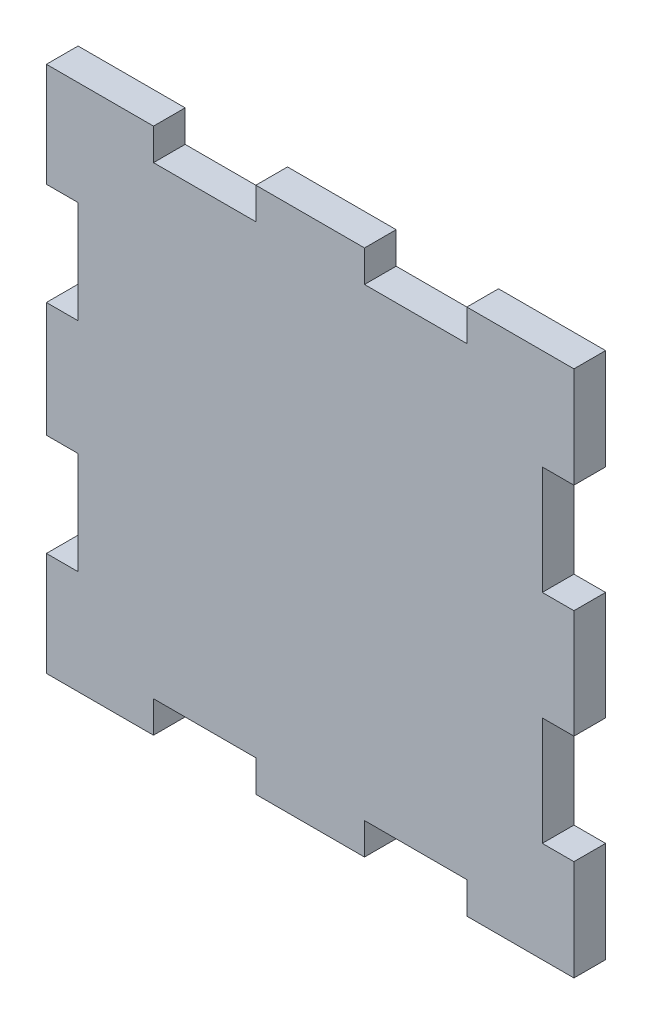
ISO-10303-21;
HEADER;
FILE_DESCRIPTION(('STEP AP214'),'2;1');
FILE_NAME('part.step','',(''),(''),'','','');
FILE_SCHEMA(('AUTOMOTIVE_DESIGN { 1 0 10303 214 1 1 1 1 }'));
ENDSEC;
DATA;
#1=APPLICATION_CONTEXT('core data for automotive mechanical design processes');
#2=APPLICATION_PROTOCOL_DEFINITION('international standard','automotive_design',2000,#1);
#3=PRODUCT_CONTEXT('',#1,'mechanical');
#4=PRODUCT('Part','Part','',(#3));
#5=PRODUCT_RELATED_PRODUCT_CATEGORY('part','',(#4));
#6=PRODUCT_DEFINITION_FORMATION('','',#4);
#7=PRODUCT_DEFINITION_CONTEXT('part definition',#1,'design');
#8=PRODUCT_DEFINITION('design','',#6,#7);
#9=PRODUCT_DEFINITION_SHAPE('','',#8);
#10=(LENGTH_UNIT() NAMED_UNIT(*) SI_UNIT(.MILLI.,.METRE.));
#11=(NAMED_UNIT(*) PLANE_ANGLE_UNIT() SI_UNIT($,.RADIAN.));
#12=(NAMED_UNIT(*) SI_UNIT($,.STERADIAN.) SOLID_ANGLE_UNIT());
#13=UNCERTAINTY_MEASURE_WITH_UNIT(LENGTH_MEASURE(1.E-05),#10,'distance_accuracy_value','');
#14=(GEOMETRIC_REPRESENTATION_CONTEXT(3) GLOBAL_UNCERTAINTY_ASSIGNED_CONTEXT((#13)) GLOBAL_UNIT_ASSIGNED_CONTEXT((#10,
#11,#12)) REPRESENTATION_CONTEXT('',''));
#15=CARTESIAN_POINT('',(0.,0.,0.));
#16=DIRECTION('',(0.,0.,1.));
#17=DIRECTION('',(1.,0.,0.));
#18=AXIS2_PLACEMENT_3D('',#15,#16,#17);
#19=CARTESIAN_POINT('',(14.85,25.,3.));
#20=DIRECTION('',(0.,-1.,0.));
#21=DIRECTION('',(1.,0.,0.));
#22=AXIS2_PLACEMENT_3D('',#19,#20,#21);
#23=PLANE('',#22);
#24=DIRECTION('',(-1.,0.,0.));
#25=VECTOR('',#24,1.);
#26=CARTESIAN_POINT('',(14.85,25.,0.));
#27=LINE('',#26,#25);
#28=CARTESIAN_POINT('',(25.,25.,0.));
#29=VERTEX_POINT('',#28);
#30=CARTESIAN_POINT('',(14.85,25.,0.));
#31=VERTEX_POINT('',#30);
#32=EDGE_CURVE('E301',#29,#31,#27,.T.);
#33=ORIENTED_EDGE('',*,*,#32,.T.);
#34=DIRECTION('',(0.,0.,-1.));
#35=VECTOR('',#34,1.);
#36=CARTESIAN_POINT('',(14.85,25.,3.));
#37=LINE('',#36,#35);
#38=CARTESIAN_POINT('',(14.85,25.,3.));
#39=VERTEX_POINT('',#38);
#40=EDGE_CURVE('E11',#39,#31,#37,.T.);
#41=ORIENTED_EDGE('',*,*,#40,.F.);
#42=DIRECTION('',(-1.,0.,0.));
#43=VECTOR('',#42,1.);
#44=CARTESIAN_POINT('',(14.85,25.,3.));
#45=LINE('',#44,#43);
#46=CARTESIAN_POINT('',(25.,25.,3.));
#47=VERTEX_POINT('',#46);
#48=EDGE_CURVE('E371',#47,#39,#45,.T.);
#49=ORIENTED_EDGE('',*,*,#48,.F.);
#50=DIRECTION('',(0.,0.,-1.));
#51=VECTOR('',#50,1.);
#52=CARTESIAN_POINT('',(25.,25.,3.));
#53=LINE('',#52,#51);
#54=EDGE_CURVE('E297',#47,#29,#53,.T.);
#55=ORIENTED_EDGE('',*,*,#54,.T.);
#56=EDGE_LOOP('',(#33,#41,#49,#55));
#57=FACE_BOUND('',#56,.T.);
#58=ADVANCED_FACE('F37',(#57),#23,.F.);
#59=CARTESIAN_POINT('',(14.85,25.,3.));
#60=DIRECTION('',(1.,0.,0.));
#61=DIRECTION('',(0.,1.,0.));
#62=AXIS2_PLACEMENT_3D('',#59,#60,#61);
#63=PLANE('',#62);
#64=DIRECTION('',(0.,-1.,0.));
#65=VECTOR('',#64,1.);
#66=CARTESIAN_POINT('',(14.85,25.,0.));
#67=LINE('',#66,#65);
#68=CARTESIAN_POINT('',(14.85,22.,0.));
#69=VERTEX_POINT('',#68);
#70=EDGE_CURVE('E304',#31,#69,#67,.T.);
#71=ORIENTED_EDGE('',*,*,#70,.T.);
#72=DIRECTION('',(0.,0.,-1.));
#73=VECTOR('',#72,1.);
#74=CARTESIAN_POINT('',(14.85,22.,3.));
#75=LINE('',#74,#73);
#76=CARTESIAN_POINT('',(14.85,22.,3.));
#77=VERTEX_POINT('',#76);
#78=EDGE_CURVE('E45',#77,#69,#75,.T.);
#79=ORIENTED_EDGE('',*,*,#78,.F.);
#80=DIRECTION('',(0.,-1.,0.));
#81=VECTOR('',#80,1.);
#82=CARTESIAN_POINT('',(14.85,25.,3.));
#83=LINE('',#82,#81);
#84=EDGE_CURVE('E180',#39,#77,#83,.T.);
#85=ORIENTED_EDGE('',*,*,#84,.F.);
#86=ORIENTED_EDGE('',*,*,#40,.T.);
#87=EDGE_LOOP('',(#71,#79,#85,#86));
#88=FACE_BOUND('',#87,.T.);
#89=ADVANCED_FACE('F569',(#88),#63,.F.);
#90=CARTESIAN_POINT('',(14.85,22.,3.));
#91=DIRECTION('',(0.,-1.,0.));
#92=DIRECTION('',(1.,0.,0.));
#93=AXIS2_PLACEMENT_3D('',#90,#91,#92);
#94=PLANE('',#93);
#95=DIRECTION('',(-1.,0.,0.));
#96=VECTOR('',#95,1.);
#97=CARTESIAN_POINT('',(14.85,22.,0.));
#98=LINE('',#97,#96);
#99=CARTESIAN_POINT('',(5.15,22.,0.));
#100=VERTEX_POINT('',#99);
#101=EDGE_CURVE('E306',#69,#100,#98,.T.);
#102=ORIENTED_EDGE('',*,*,#101,.T.);
#103=DIRECTION('',(0.,0.,-1.));
#104=VECTOR('',#103,1.);
#105=CARTESIAN_POINT('',(5.15,22.,3.));
#106=LINE('',#105,#104);
#107=CARTESIAN_POINT('',(5.15,22.,3.));
#108=VERTEX_POINT('',#107);
#109=EDGE_CURVE('E462',#108,#100,#106,.T.);
#110=ORIENTED_EDGE('',*,*,#109,.F.);
#111=DIRECTION('',(-1.,0.,0.));
#112=VECTOR('',#111,1.);
#113=CARTESIAN_POINT('',(14.85,22.,3.));
#114=LINE('',#113,#112);
#115=EDGE_CURVE('E470',#77,#108,#114,.T.);
#116=ORIENTED_EDGE('',*,*,#115,.F.);
#117=ORIENTED_EDGE('',*,*,#78,.T.);
#118=EDGE_LOOP('',(#102,#110,#116,#117));
#119=FACE_BOUND('',#118,.T.);
#120=ADVANCED_FACE('F468',(#119),#94,.F.);
#121=CARTESIAN_POINT('',(5.15,25.,3.));
#122=DIRECTION('',(-1.,0.,0.));
#123=DIRECTION('',(0.,-1.,0.));
#124=AXIS2_PLACEMENT_3D('',#121,#122,#123);
#125=PLANE('',#124);
#126=DIRECTION('',(0.,1.,0.));
#127=VECTOR('',#126,1.);
#128=CARTESIAN_POINT('',(5.15,25.,0.));
#129=LINE('',#128,#127);
#130=CARTESIAN_POINT('',(5.15,25.,0.));
#131=VERTEX_POINT('',#130);
#132=EDGE_CURVE('E308',#100,#131,#129,.T.);
#133=ORIENTED_EDGE('',*,*,#132,.T.);
#134=DIRECTION('',(0.,0.,-1.));
#135=VECTOR('',#134,1.);
#136=CARTESIAN_POINT('',(5.15,25.,3.));
#137=LINE('',#136,#135);
#138=CARTESIAN_POINT('',(5.15,25.,3.));
#139=VERTEX_POINT('',#138);
#140=EDGE_CURVE('E459',#139,#131,#137,.T.);
#141=ORIENTED_EDGE('',*,*,#140,.F.);
#142=DIRECTION('',(0.,1.,0.));
#143=VECTOR('',#142,1.);
#144=CARTESIAN_POINT('',(5.15,25.,3.));
#145=LINE('',#144,#143);
#146=EDGE_CURVE('E488',#108,#139,#145,.T.);
#147=ORIENTED_EDGE('',*,*,#146,.F.);
#148=ORIENTED_EDGE('',*,*,#109,.T.);
#149=EDGE_LOOP('',(#133,#141,#147,#148));
#150=FACE_BOUND('',#149,.T.);
#151=ADVANCED_FACE('F479',(#150),#125,.F.);
#152=CARTESIAN_POINT('',(-5.15,25.,3.));
#153=DIRECTION('',(0.,-1.,0.));
#154=DIRECTION('',(0.,0.,-1.));
#155=AXIS2_PLACEMENT_3D('',#152,#153,#154);
#156=PLANE('',#155);
#157=DIRECTION('',(-1.,0.,0.));
#158=VECTOR('',#157,1.);
#159=CARTESIAN_POINT('',(-5.15,25.,0.));
#160=LINE('',#159,#158);
#161=CARTESIAN_POINT('',(-5.15,25.,0.));
#162=VERTEX_POINT('',#161);
#163=EDGE_CURVE('E310',#131,#162,#160,.T.);
#164=ORIENTED_EDGE('',*,*,#163,.T.);
#165=DIRECTION('',(0.,0.,-1.));
#166=VECTOR('',#165,1.);
#167=CARTESIAN_POINT('',(-5.15,25.,3.));
#168=LINE('',#167,#166);
#169=CARTESIAN_POINT('',(-5.15,25.,3.));
#170=VERTEX_POINT('',#169);
#171=EDGE_CURVE('E456',#170,#162,#168,.T.);
#172=ORIENTED_EDGE('',*,*,#171,.F.);
#173=DIRECTION('',(-1.,0.,0.));
#174=VECTOR('',#173,1.);
#175=CARTESIAN_POINT('',(-5.15,25.,3.));
#176=LINE('',#175,#174);
#177=EDGE_CURVE('E485',#139,#170,#176,.T.);
#178=ORIENTED_EDGE('',*,*,#177,.F.);
#179=ORIENTED_EDGE('',*,*,#140,.T.);
#180=EDGE_LOOP('',(#164,#172,#178,#179));
#181=FACE_BOUND('',#180,.T.);
#182=ADVANCED_FACE('F483',(#181),#156,.F.);
#183=CARTESIAN_POINT('',(-5.15,25.,3.));
#184=DIRECTION('',(1.,0.,0.));
#185=DIRECTION('',(0.,1.,0.));
#186=AXIS2_PLACEMENT_3D('',#183,#184,#185);
#187=PLANE('',#186);
#188=DIRECTION('',(0.,-1.,0.));
#189=VECTOR('',#188,1.);
#190=CARTESIAN_POINT('',(-5.15,25.,0.));
#191=LINE('',#190,#189);
#192=CARTESIAN_POINT('',(-5.15,22.,0.));
#193=VERTEX_POINT('',#192);
#194=EDGE_CURVE('E312',#162,#193,#191,.T.);
#195=ORIENTED_EDGE('',*,*,#194,.T.);
#196=DIRECTION('',(0.,0.,-1.));
#197=VECTOR('',#196,1.);
#198=CARTESIAN_POINT('',(-5.15,22.,3.));
#199=LINE('',#198,#197);
#200=CARTESIAN_POINT('',(-5.15,22.,3.));
#201=VERTEX_POINT('',#200);
#202=EDGE_CURVE('E453',#201,#193,#199,.T.);
#203=ORIENTED_EDGE('',*,*,#202,.F.);
#204=DIRECTION('',(0.,-1.,0.));
#205=VECTOR('',#204,1.);
#206=CARTESIAN_POINT('',(-5.15,25.,3.));
#207=LINE('',#206,#205);
#208=EDGE_CURVE('E487',#170,#201,#207,.T.);
#209=ORIENTED_EDGE('',*,*,#208,.F.);
#210=ORIENTED_EDGE('',*,*,#171,.T.);
#211=EDGE_LOOP('',(#195,#203,#209,#210));
#212=FACE_BOUND('',#211,.T.);
#213=ADVANCED_FACE('F582',(#212),#187,.F.);
#214=CARTESIAN_POINT('',(-14.85,22.,3.));
#215=DIRECTION('',(0.,-1.,0.));
#216=DIRECTION('',(1.,0.,0.));
#217=AXIS2_PLACEMENT_3D('',#214,#215,#216);
#218=PLANE('',#217);
#219=DIRECTION('',(-1.,0.,0.));
#220=VECTOR('',#219,1.);
#221=CARTESIAN_POINT('',(-14.85,22.,0.));
#222=LINE('',#221,#220);
#223=CARTESIAN_POINT('',(-14.85,22.,0.));
#224=VERTEX_POINT('',#223);
#225=EDGE_CURVE('E314',#193,#224,#222,.T.);
#226=ORIENTED_EDGE('',*,*,#225,.T.);
#227=DIRECTION('',(0.,0.,-1.));
#228=VECTOR('',#227,1.);
#229=CARTESIAN_POINT('',(-14.85,22.,3.));
#230=LINE('',#229,#228);
#231=CARTESIAN_POINT('',(-14.85,22.,3.));
#232=VERTEX_POINT('',#231);
#233=EDGE_CURVE('E450',#232,#224,#230,.T.);
#234=ORIENTED_EDGE('',*,*,#233,.F.);
#235=DIRECTION('',(-1.,0.,0.));
#236=VECTOR('',#235,1.);
#237=CARTESIAN_POINT('',(-14.85,22.,3.));
#238=LINE('',#237,#236);
#239=EDGE_CURVE('E490',#201,#232,#238,.T.);
#240=ORIENTED_EDGE('',*,*,#239,.F.);
#241=ORIENTED_EDGE('',*,*,#202,.T.);
#242=EDGE_LOOP('',(#226,#234,#240,#241));
#243=FACE_BOUND('',#242,.T.);
#244=ADVANCED_FACE('F585',(#243),#218,.F.);
#245=CARTESIAN_POINT('',(-14.85,25.,3.));
#246=DIRECTION('',(-1.,0.,0.));
#247=DIRECTION('',(0.,-1.,0.));
#248=AXIS2_PLACEMENT_3D('',#245,#246,#247);
#249=PLANE('',#248);
#250=DIRECTION('',(0.,1.,0.));
#251=VECTOR('',#250,1.);
#252=CARTESIAN_POINT('',(-14.85,25.,0.));
#253=LINE('',#252,#251);
#254=CARTESIAN_POINT('',(-14.85,25.,0.));
#255=VERTEX_POINT('',#254);
#256=EDGE_CURVE('E316',#224,#255,#253,.T.);
#257=ORIENTED_EDGE('',*,*,#256,.T.);
#258=DIRECTION('',(0.,0.,-1.));
#259=VECTOR('',#258,1.);
#260=CARTESIAN_POINT('',(-14.85,25.,3.));
#261=LINE('',#260,#259);
#262=CARTESIAN_POINT('',(-14.85,25.,3.));
#263=VERTEX_POINT('',#262);
#264=EDGE_CURVE('E447',#263,#255,#261,.T.);
#265=ORIENTED_EDGE('',*,*,#264,.F.);
#266=DIRECTION('',(0.,1.,0.));
#267=VECTOR('',#266,1.);
#268=CARTESIAN_POINT('',(-14.85,25.,3.));
#269=LINE('',#268,#267);
#270=EDGE_CURVE('E496',#232,#263,#269,.T.);
#271=ORIENTED_EDGE('',*,*,#270,.F.);
#272=ORIENTED_EDGE('',*,*,#233,.T.);
#273=EDGE_LOOP('',(#257,#265,#271,#272));
#274=FACE_BOUND('',#273,.T.);
#275=ADVANCED_FACE('F589',(#274),#249,.F.);
#276=CARTESIAN_POINT('',(-25.,25.,3.));
#277=DIRECTION('',(0.,-1.,0.));
#278=DIRECTION('',(0.,0.,-1.));
#279=AXIS2_PLACEMENT_3D('',#276,#277,#278);
#280=PLANE('',#279);
#281=DIRECTION('',(-1.,0.,0.));
#282=VECTOR('',#281,1.);
#283=CARTESIAN_POINT('',(-25.,25.,0.));
#284=LINE('',#283,#282);
#285=CARTESIAN_POINT('',(-25.,25.,0.));
#286=VERTEX_POINT('',#285);
#287=EDGE_CURVE('E318',#255,#286,#284,.T.);
#288=ORIENTED_EDGE('',*,*,#287,.T.);
#289=DIRECTION('',(0.,0.,-1.));
#290=VECTOR('',#289,1.);
#291=CARTESIAN_POINT('',(-25.,25.,3.));
#292=LINE('',#291,#290);
#293=CARTESIAN_POINT('',(-25.,25.,3.));
#294=VERTEX_POINT('',#293);
#295=EDGE_CURVE('E444',#294,#286,#292,.T.);
#296=ORIENTED_EDGE('',*,*,#295,.F.);
#297=DIRECTION('',(-1.,0.,0.));
#298=VECTOR('',#297,1.);
#299=CARTESIAN_POINT('',(-25.,25.,3.));
#300=LINE('',#299,#298);
#301=EDGE_CURVE('E498',#263,#294,#300,.T.);
#302=ORIENTED_EDGE('',*,*,#301,.F.);
#303=ORIENTED_EDGE('',*,*,#264,.T.);
#304=EDGE_LOOP('',(#288,#296,#302,#303));
#305=FACE_BOUND('',#304,.T.);
#306=ADVANCED_FACE('F593',(#305),#280,.F.);
#307=CARTESIAN_POINT('',(-25.,15.15,3.));
#308=DIRECTION('',(1.,0.,0.));
#309=DIRECTION('',(0.,1.,0.));
#310=AXIS2_PLACEMENT_3D('',#307,#308,#309);
#311=PLANE('',#310);
#312=DIRECTION('',(0.,-1.,0.));
#313=VECTOR('',#312,1.);
#314=CARTESIAN_POINT('',(-25.,15.15,0.));
#315=LINE('',#314,#313);
#316=CARTESIAN_POINT('',(-25.,15.15,0.));
#317=VERTEX_POINT('',#316);
#318=EDGE_CURVE('E320',#286,#317,#315,.T.);
#319=ORIENTED_EDGE('',*,*,#318,.T.);
#320=DIRECTION('',(0.,0.,-1.));
#321=VECTOR('',#320,1.);
#322=CARTESIAN_POINT('',(-25.,15.15,3.));
#323=LINE('',#322,#321);
#324=CARTESIAN_POINT('',(-25.,15.15,3.));
#325=VERTEX_POINT('',#324);
#326=EDGE_CURVE('E441',#325,#317,#323,.T.);
#327=ORIENTED_EDGE('',*,*,#326,.F.);
#328=DIRECTION('',(0.,-1.,0.));
#329=VECTOR('',#328,1.);
#330=CARTESIAN_POINT('',(-25.,15.15,3.));
#331=LINE('',#330,#329);
#332=EDGE_CURVE('E500',#294,#325,#331,.T.);
#333=ORIENTED_EDGE('',*,*,#332,.F.);
#334=ORIENTED_EDGE('',*,*,#295,.T.);
#335=EDGE_LOOP('',(#319,#327,#333,#334));
#336=FACE_BOUND('',#335,.T.);
#337=ADVANCED_FACE('F597',(#336),#311,.F.);
#338=CARTESIAN_POINT('',(-25.,15.15,3.));
#339=DIRECTION('',(0.,1.,0.));
#340=DIRECTION('',(-1.,0.,0.));
#341=AXIS2_PLACEMENT_3D('',#338,#339,#340);
#342=PLANE('',#341);
#343=DIRECTION('',(1.,0.,0.));
#344=VECTOR('',#343,1.);
#345=CARTESIAN_POINT('',(-25.,15.15,0.));
#346=LINE('',#345,#344);
#347=CARTESIAN_POINT('',(-22.,15.15,0.));
#348=VERTEX_POINT('',#347);
#349=EDGE_CURVE('E322',#317,#348,#346,.T.);
#350=ORIENTED_EDGE('',*,*,#349,.T.);
#351=DIRECTION('',(0.,0.,-1.));
#352=VECTOR('',#351,1.);
#353=CARTESIAN_POINT('',(-22.,15.15,3.));
#354=LINE('',#353,#352);
#355=CARTESIAN_POINT('',(-22.,15.15,3.));
#356=VERTEX_POINT('',#355);
#357=EDGE_CURVE('E438',#356,#348,#354,.T.);
#358=ORIENTED_EDGE('',*,*,#357,.F.);
#359=DIRECTION('',(1.,0.,0.));
#360=VECTOR('',#359,1.);
#361=CARTESIAN_POINT('',(-25.,15.15,3.));
#362=LINE('',#361,#360);
#363=EDGE_CURVE('E502',#325,#356,#362,.T.);
#364=ORIENTED_EDGE('',*,*,#363,.F.);
#365=ORIENTED_EDGE('',*,*,#326,.T.);
#366=EDGE_LOOP('',(#350,#358,#364,#365));
#367=FACE_BOUND('',#366,.T.);
#368=ADVANCED_FACE('F601',(#367),#342,.F.);
#369=CARTESIAN_POINT('',(-22.,15.15,3.));
#370=DIRECTION('',(1.,0.,0.));
#371=DIRECTION('',(0.,0.,-1.));
#372=AXIS2_PLACEMENT_3D('',#369,#370,#371);
#373=PLANE('',#372);
#374=DIRECTION('',(0.,-1.,0.));
#375=VECTOR('',#374,1.);
#376=CARTESIAN_POINT('',(-22.,15.15,0.));
#377=LINE('',#376,#375);
#378=CARTESIAN_POINT('',(-22.,5.45,0.));
#379=VERTEX_POINT('',#378);
#380=EDGE_CURVE('E324',#348,#379,#377,.T.);
#381=ORIENTED_EDGE('',*,*,#380,.T.);
#382=DIRECTION('',(0.,0.,-1.));
#383=VECTOR('',#382,1.);
#384=CARTESIAN_POINT('',(-22.,5.45,3.));
#385=LINE('',#384,#383);
#386=CARTESIAN_POINT('',(-22.,5.45,3.));
#387=VERTEX_POINT('',#386);
#388=EDGE_CURVE('E435',#387,#379,#385,.T.);
#389=ORIENTED_EDGE('',*,*,#388,.F.);
#390=DIRECTION('',(0.,-1.,0.));
#391=VECTOR('',#390,1.);
#392=CARTESIAN_POINT('',(-22.,15.15,3.));
#393=LINE('',#392,#391);
#394=EDGE_CURVE('E504',#356,#387,#393,.T.);
#395=ORIENTED_EDGE('',*,*,#394,.F.);
#396=ORIENTED_EDGE('',*,*,#357,.T.);
#397=EDGE_LOOP('',(#381,#389,#395,#396));
#398=FACE_BOUND('',#397,.T.);
#399=ADVANCED_FACE('F605',(#398),#373,.F.);
#400=CARTESIAN_POINT('',(-25.,5.45,3.));
#401=DIRECTION('',(0.,-1.,0.));
#402=DIRECTION('',(0.,0.,-1.));
#403=AXIS2_PLACEMENT_3D('',#400,#401,#402);
#404=PLANE('',#403);
#405=DIRECTION('',(-1.,0.,0.));
#406=VECTOR('',#405,1.);
#407=CARTESIAN_POINT('',(-25.,5.45,0.));
#408=LINE('',#407,#406);
#409=CARTESIAN_POINT('',(-25.,5.45,0.));
#410=VERTEX_POINT('',#409);
#411=EDGE_CURVE('E326',#379,#410,#408,.T.);
#412=ORIENTED_EDGE('',*,*,#411,.T.);
#413=DIRECTION('',(0.,0.,-1.));
#414=VECTOR('',#413,1.);
#415=CARTESIAN_POINT('',(-25.,5.45,3.));
#416=LINE('',#415,#414);
#417=CARTESIAN_POINT('',(-25.,5.45,3.));
#418=VERTEX_POINT('',#417);
#419=EDGE_CURVE('E432',#418,#410,#416,.T.);
#420=ORIENTED_EDGE('',*,*,#419,.F.);
#421=DIRECTION('',(-1.,0.,0.));
#422=VECTOR('',#421,1.);
#423=CARTESIAN_POINT('',(-25.,5.45,3.));
#424=LINE('',#423,#422);
#425=EDGE_CURVE('E506',#387,#418,#424,.T.);
#426=ORIENTED_EDGE('',*,*,#425,.F.);
#427=ORIENTED_EDGE('',*,*,#388,.T.);
#428=EDGE_LOOP('',(#412,#420,#426,#427));
#429=FACE_BOUND('',#428,.T.);
#430=ADVANCED_FACE('F609',(#429),#404,.F.);
#431=CARTESIAN_POINT('',(-25.,-5.45,3.));
#432=DIRECTION('',(1.,0.,0.));
#433=DIRECTION('',(0.,0.,-1.));
#434=AXIS2_PLACEMENT_3D('',#431,#432,#433);
#435=PLANE('',#434);
#436=DIRECTION('',(0.,-1.,0.));
#437=VECTOR('',#436,1.);
#438=CARTESIAN_POINT('',(-25.,-5.45,0.));
#439=LINE('',#438,#437);
#440=CARTESIAN_POINT('',(-25.,-5.45,0.));
#441=VERTEX_POINT('',#440);
#442=EDGE_CURVE('E328',#410,#441,#439,.T.);
#443=ORIENTED_EDGE('',*,*,#442,.T.);
#444=DIRECTION('',(0.,0.,-1.));
#445=VECTOR('',#444,1.);
#446=CARTESIAN_POINT('',(-25.,-5.45,3.));
#447=LINE('',#446,#445);
#448=CARTESIAN_POINT('',(-25.,-5.45,3.));
#449=VERTEX_POINT('',#448);
#450=EDGE_CURVE('E429',#449,#441,#447,.T.);
#451=ORIENTED_EDGE('',*,*,#450,.F.);
#452=DIRECTION('',(0.,-1.,0.));
#453=VECTOR('',#452,1.);
#454=CARTESIAN_POINT('',(-25.,-5.45,3.));
#455=LINE('',#454,#453);
#456=EDGE_CURVE('E508',#418,#449,#455,.T.);
#457=ORIENTED_EDGE('',*,*,#456,.F.);
#458=ORIENTED_EDGE('',*,*,#419,.T.);
#459=EDGE_LOOP('',(#443,#451,#457,#458));
#460=FACE_BOUND('',#459,.T.);
#461=ADVANCED_FACE('F613',(#460),#435,.F.);
#462=CARTESIAN_POINT('',(-25.,-5.45,3.));
#463=DIRECTION('',(0.,1.,0.));
#464=DIRECTION('',(0.,0.,1.));
#465=AXIS2_PLACEMENT_3D('',#462,#463,#464);
#466=PLANE('',#465);
#467=DIRECTION('',(1.,0.,0.));
#468=VECTOR('',#467,1.);
#469=CARTESIAN_POINT('',(-25.,-5.45,0.));
#470=LINE('',#469,#468);
#471=CARTESIAN_POINT('',(-22.,-5.45,0.));
#472=VERTEX_POINT('',#471);
#473=EDGE_CURVE('E330',#441,#472,#470,.T.);
#474=ORIENTED_EDGE('',*,*,#473,.T.);
#475=DIRECTION('',(0.,0.,-1.));
#476=VECTOR('',#475,1.);
#477=CARTESIAN_POINT('',(-22.,-5.45,3.));
#478=LINE('',#477,#476);
#479=CARTESIAN_POINT('',(-22.,-5.45,3.));
#480=VERTEX_POINT('',#479);
#481=EDGE_CURVE('E426',#480,#472,#478,.T.);
#482=ORIENTED_EDGE('',*,*,#481,.F.);
#483=DIRECTION('',(1.,0.,0.));
#484=VECTOR('',#483,1.);
#485=CARTESIAN_POINT('',(-25.,-5.45,3.));
#486=LINE('',#485,#484);
#487=EDGE_CURVE('E510',#449,#480,#486,.T.);
#488=ORIENTED_EDGE('',*,*,#487,.F.);
#489=ORIENTED_EDGE('',*,*,#450,.T.);
#490=EDGE_LOOP('',(#474,#482,#488,#489));
#491=FACE_BOUND('',#490,.T.);
#492=ADVANCED_FACE('F617',(#491),#466,.F.);
#493=CARTESIAN_POINT('',(-22.,-15.15,3.));
#494=DIRECTION('',(1.,0.,0.));
#495=DIRECTION('',(0.,0.,-1.));
#496=AXIS2_PLACEMENT_3D('',#493,#494,#495);
#497=PLANE('',#496);
#498=DIRECTION('',(0.,-1.,0.));
#499=VECTOR('',#498,1.);
#500=CARTESIAN_POINT('',(-22.,-15.15,0.));
#501=LINE('',#500,#499);
#502=CARTESIAN_POINT('',(-22.,-15.15,0.));
#503=VERTEX_POINT('',#502);
#504=EDGE_CURVE('E332',#472,#503,#501,.T.);
#505=ORIENTED_EDGE('',*,*,#504,.T.);
#506=DIRECTION('',(0.,0.,-1.));
#507=VECTOR('',#506,1.);
#508=CARTESIAN_POINT('',(-22.,-15.15,3.));
#509=LINE('',#508,#507);
#510=CARTESIAN_POINT('',(-22.,-15.15,3.));
#511=VERTEX_POINT('',#510);
#512=EDGE_CURVE('E423',#511,#503,#509,.T.);
#513=ORIENTED_EDGE('',*,*,#512,.F.);
#514=DIRECTION('',(0.,-1.,0.));
#515=VECTOR('',#514,1.);
#516=CARTESIAN_POINT('',(-22.,-15.15,3.));
#517=LINE('',#516,#515);
#518=EDGE_CURVE('E512',#480,#511,#517,.T.);
#519=ORIENTED_EDGE('',*,*,#518,.F.);
#520=ORIENTED_EDGE('',*,*,#481,.T.);
#521=EDGE_LOOP('',(#505,#513,#519,#520));
#522=FACE_BOUND('',#521,.T.);
#523=ADVANCED_FACE('F621',(#522),#497,.F.);
#524=CARTESIAN_POINT('',(-25.,-15.15,3.));
#525=DIRECTION('',(0.,-1.,0.));
#526=DIRECTION('',(1.,0.,0.));
#527=AXIS2_PLACEMENT_3D('',#524,#525,#526);
#528=PLANE('',#527);
#529=DIRECTION('',(-1.,0.,0.));
#530=VECTOR('',#529,1.);
#531=CARTESIAN_POINT('',(-25.,-15.15,0.));
#532=LINE('',#531,#530);
#533=CARTESIAN_POINT('',(-25.,-15.15,0.));
#534=VERTEX_POINT('',#533);
#535=EDGE_CURVE('E334',#503,#534,#532,.T.);
#536=ORIENTED_EDGE('',*,*,#535,.T.);
#537=DIRECTION('',(0.,0.,-1.));
#538=VECTOR('',#537,1.);
#539=CARTESIAN_POINT('',(-25.,-15.15,3.));
#540=LINE('',#539,#538);
#541=CARTESIAN_POINT('',(-25.,-15.15,3.));
#542=VERTEX_POINT('',#541);
#543=EDGE_CURVE('E420',#542,#534,#540,.T.);
#544=ORIENTED_EDGE('',*,*,#543,.F.);
#545=DIRECTION('',(-1.,0.,0.));
#546=VECTOR('',#545,1.);
#547=CARTESIAN_POINT('',(-25.,-15.15,3.));
#548=LINE('',#547,#546);
#549=EDGE_CURVE('E514',#511,#542,#548,.T.);
#550=ORIENTED_EDGE('',*,*,#549,.F.);
#551=ORIENTED_EDGE('',*,*,#512,.T.);
#552=EDGE_LOOP('',(#536,#544,#550,#551));
#553=FACE_BOUND('',#552,.T.);
#554=ADVANCED_FACE('F625',(#553),#528,.F.);
#555=CARTESIAN_POINT('',(-25.,-25.,3.));
#556=DIRECTION('',(1.,0.,0.));
#557=DIRECTION('',(0.,0.,-1.));
#558=AXIS2_PLACEMENT_3D('',#555,#556,#557);
#559=PLANE('',#558);
#560=DIRECTION('',(0.,-1.,0.));
#561=VECTOR('',#560,1.);
#562=CARTESIAN_POINT('',(-25.,-25.,0.));
#563=LINE('',#562,#561);
#564=CARTESIAN_POINT('',(-25.,-25.,0.));
#565=VERTEX_POINT('',#564);
#566=EDGE_CURVE('E336',#534,#565,#563,.T.);
#567=ORIENTED_EDGE('',*,*,#566,.T.);
#568=DIRECTION('',(0.,0.,-1.));
#569=VECTOR('',#568,1.);
#570=CARTESIAN_POINT('',(-25.,-25.,3.));
#571=LINE('',#570,#569);
#572=CARTESIAN_POINT('',(-25.,-25.,3.));
#573=VERTEX_POINT('',#572);
#574=EDGE_CURVE('E417',#573,#565,#571,.T.);
#575=ORIENTED_EDGE('',*,*,#574,.F.);
#576=DIRECTION('',(0.,-1.,0.));
#577=VECTOR('',#576,1.);
#578=CARTESIAN_POINT('',(-25.,-25.,3.));
#579=LINE('',#578,#577);
#580=EDGE_CURVE('E516',#542,#573,#579,.T.);
#581=ORIENTED_EDGE('',*,*,#580,.F.);
#582=ORIENTED_EDGE('',*,*,#543,.T.);
#583=EDGE_LOOP('',(#567,#575,#581,#582));
#584=FACE_BOUND('',#583,.T.);
#585=ADVANCED_FACE('F629',(#584),#559,.F.);
#586=CARTESIAN_POINT('',(-25.,-25.,3.));
#587=DIRECTION('',(0.,1.,0.));
#588=DIRECTION('',(0.,0.,1.));
#589=AXIS2_PLACEMENT_3D('',#586,#587,#588);
#590=PLANE('',#589);
#591=DIRECTION('',(1.,0.,0.));
#592=VECTOR('',#591,1.);
#593=CARTESIAN_POINT('',(-25.,-25.,0.));
#594=LINE('',#593,#592);
#595=CARTESIAN_POINT('',(-14.85,-25.,0.));
#596=VERTEX_POINT('',#595);
#597=EDGE_CURVE('E338',#565,#596,#594,.T.);
#598=ORIENTED_EDGE('',*,*,#597,.T.);
#599=DIRECTION('',(0.,0.,-1.));
#600=VECTOR('',#599,1.);
#601=CARTESIAN_POINT('',(-14.85,-25.,3.));
#602=LINE('',#601,#600);
#603=CARTESIAN_POINT('',(-14.85,-25.,3.));
#604=VERTEX_POINT('',#603);
#605=EDGE_CURVE('E414',#604,#596,#602,.T.);
#606=ORIENTED_EDGE('',*,*,#605,.F.);
#607=DIRECTION('',(1.,0.,0.));
#608=VECTOR('',#607,1.);
#609=CARTESIAN_POINT('',(-25.,-25.,3.));
#610=LINE('',#609,#608);
#611=EDGE_CURVE('E518',#573,#604,#610,.T.);
#612=ORIENTED_EDGE('',*,*,#611,.F.);
#613=ORIENTED_EDGE('',*,*,#574,.T.);
#614=EDGE_LOOP('',(#598,#606,#612,#613));
#615=FACE_BOUND('',#614,.T.);
#616=ADVANCED_FACE('F633',(#615),#590,.F.);
#617=CARTESIAN_POINT('',(-14.85,-25.,3.));
#618=DIRECTION('',(-1.,0.,0.));
#619=DIRECTION('',(0.,-1.,0.));
#620=AXIS2_PLACEMENT_3D('',#617,#618,#619);
#621=PLANE('',#620);
#622=DIRECTION('',(0.,1.,0.));
#623=VECTOR('',#622,1.);
#624=CARTESIAN_POINT('',(-14.85,-25.,0.));
#625=LINE('',#624,#623);
#626=CARTESIAN_POINT('',(-14.85,-22.,0.));
#627=VERTEX_POINT('',#626);
#628=EDGE_CURVE('E340',#596,#627,#625,.T.);
#629=ORIENTED_EDGE('',*,*,#628,.T.);
#630=DIRECTION('',(0.,0.,-1.));
#631=VECTOR('',#630,1.);
#632=CARTESIAN_POINT('',(-14.85,-22.,3.));
#633=LINE('',#632,#631);
#634=CARTESIAN_POINT('',(-14.85,-22.,3.));
#635=VERTEX_POINT('',#634);
#636=EDGE_CURVE('E411',#635,#627,#633,.T.);
#637=ORIENTED_EDGE('',*,*,#636,.F.);
#638=DIRECTION('',(0.,1.,0.));
#639=VECTOR('',#638,1.);
#640=CARTESIAN_POINT('',(-14.85,-25.,3.));
#641=LINE('',#640,#639);
#642=EDGE_CURVE('E520',#604,#635,#641,.T.);
#643=ORIENTED_EDGE('',*,*,#642,.F.);
#644=ORIENTED_EDGE('',*,*,#605,.T.);
#645=EDGE_LOOP('',(#629,#637,#643,#644));
#646=FACE_BOUND('',#645,.T.);
#647=ADVANCED_FACE('F637',(#646),#621,.F.);
#648=CARTESIAN_POINT('',(-14.85,-22.,3.));
#649=DIRECTION('',(0.,1.,0.));
#650=DIRECTION('',(0.,0.,1.));
#651=AXIS2_PLACEMENT_3D('',#648,#649,#650);
#652=PLANE('',#651);
#653=DIRECTION('',(1.,0.,0.));
#654=VECTOR('',#653,1.);
#655=CARTESIAN_POINT('',(-14.85,-22.,0.));
#656=LINE('',#655,#654);
#657=CARTESIAN_POINT('',(-5.15,-22.,0.));
#658=VERTEX_POINT('',#657);
#659=EDGE_CURVE('E342',#627,#658,#656,.T.);
#660=ORIENTED_EDGE('',*,*,#659,.T.);
#661=DIRECTION('',(0.,0.,-1.));
#662=VECTOR('',#661,1.);
#663=CARTESIAN_POINT('',(-5.15,-22.,3.));
#664=LINE('',#663,#662);
#665=CARTESIAN_POINT('',(-5.15,-22.,3.));
#666=VERTEX_POINT('',#665);
#667=EDGE_CURVE('E408',#666,#658,#664,.T.);
#668=ORIENTED_EDGE('',*,*,#667,.F.);
#669=DIRECTION('',(1.,0.,0.));
#670=VECTOR('',#669,1.);
#671=CARTESIAN_POINT('',(-14.85,-22.,3.));
#672=LINE('',#671,#670);
#673=EDGE_CURVE('E522',#635,#666,#672,.T.);
#674=ORIENTED_EDGE('',*,*,#673,.F.);
#675=ORIENTED_EDGE('',*,*,#636,.T.);
#676=EDGE_LOOP('',(#660,#668,#674,#675));
#677=FACE_BOUND('',#676,.T.);
#678=ADVANCED_FACE('F641',(#677),#652,.F.);
#679=CARTESIAN_POINT('',(-5.15,-25.,3.));
#680=DIRECTION('',(1.,0.,0.));
#681=DIRECTION('',(0.,0.,-1.));
#682=AXIS2_PLACEMENT_3D('',#679,#680,#681);
#683=PLANE('',#682);
#684=DIRECTION('',(0.,-1.,0.));
#685=VECTOR('',#684,1.);
#686=CARTESIAN_POINT('',(-5.15,-25.,0.));
#687=LINE('',#686,#685);
#688=CARTESIAN_POINT('',(-5.15,-25.,0.));
#689=VERTEX_POINT('',#688);
#690=EDGE_CURVE('E344',#658,#689,#687,.T.);
#691=ORIENTED_EDGE('',*,*,#690,.T.);
#692=DIRECTION('',(0.,0.,-1.));
#693=VECTOR('',#692,1.);
#694=CARTESIAN_POINT('',(-5.15,-25.,3.));
#695=LINE('',#694,#693);
#696=CARTESIAN_POINT('',(-5.15,-25.,3.));
#697=VERTEX_POINT('',#696);
#698=EDGE_CURVE('E405',#697,#689,#695,.T.);
#699=ORIENTED_EDGE('',*,*,#698,.F.);
#700=DIRECTION('',(0.,-1.,0.));
#701=VECTOR('',#700,1.);
#702=CARTESIAN_POINT('',(-5.15,-25.,3.));
#703=LINE('',#702,#701);
#704=EDGE_CURVE('E524',#666,#697,#703,.T.);
#705=ORIENTED_EDGE('',*,*,#704,.F.);
#706=ORIENTED_EDGE('',*,*,#667,.T.);
#707=EDGE_LOOP('',(#691,#699,#705,#706));
#708=FACE_BOUND('',#707,.T.);
#709=ADVANCED_FACE('F645',(#708),#683,.F.);
#710=CARTESIAN_POINT('',(-5.15,-25.,3.));
#711=DIRECTION('',(0.,1.,0.));
#712=DIRECTION('',(0.,0.,1.));
#713=AXIS2_PLACEMENT_3D('',#710,#711,#712);
#714=PLANE('',#713);
#715=DIRECTION('',(1.,0.,0.));
#716=VECTOR('',#715,1.);
#717=CARTESIAN_POINT('',(-5.15,-25.,0.));
#718=LINE('',#717,#716);
#719=CARTESIAN_POINT('',(5.15,-25.,0.));
#720=VERTEX_POINT('',#719);
#721=EDGE_CURVE('E346',#689,#720,#718,.T.);
#722=ORIENTED_EDGE('',*,*,#721,.T.);
#723=DIRECTION('',(0.,0.,-1.));
#724=VECTOR('',#723,1.);
#725=CARTESIAN_POINT('',(5.15,-25.,3.));
#726=LINE('',#725,#724);
#727=CARTESIAN_POINT('',(5.15,-25.,3.));
#728=VERTEX_POINT('',#727);
#729=EDGE_CURVE('E402',#728,#720,#726,.T.);
#730=ORIENTED_EDGE('',*,*,#729,.F.);
#731=DIRECTION('',(1.,0.,0.));
#732=VECTOR('',#731,1.);
#733=CARTESIAN_POINT('',(-5.15,-25.,3.));
#734=LINE('',#733,#732);
#735=EDGE_CURVE('E526',#697,#728,#734,.T.);
#736=ORIENTED_EDGE('',*,*,#735,.F.);
#737=ORIENTED_EDGE('',*,*,#698,.T.);
#738=EDGE_LOOP('',(#722,#730,#736,#737));
#739=FACE_BOUND('',#738,.T.);
#740=ADVANCED_FACE('F649',(#739),#714,.F.);
#741=CARTESIAN_POINT('',(5.15,-25.,3.));
#742=DIRECTION('',(-1.,0.,0.));
#743=DIRECTION('',(0.,-1.,0.));
#744=AXIS2_PLACEMENT_3D('',#741,#742,#743);
#745=PLANE('',#744);
#746=DIRECTION('',(0.,1.,0.));
#747=VECTOR('',#746,1.);
#748=CARTESIAN_POINT('',(5.15,-25.,0.));
#749=LINE('',#748,#747);
#750=CARTESIAN_POINT('',(5.15,-22.,0.));
#751=VERTEX_POINT('',#750);
#752=EDGE_CURVE('E348',#720,#751,#749,.T.);
#753=ORIENTED_EDGE('',*,*,#752,.T.);
#754=DIRECTION('',(0.,0.,-1.));
#755=VECTOR('',#754,1.);
#756=CARTESIAN_POINT('',(5.15,-22.,3.));
#757=LINE('',#756,#755);
#758=CARTESIAN_POINT('',(5.15,-22.,3.));
#759=VERTEX_POINT('',#758);
#760=EDGE_CURVE('E399',#759,#751,#757,.T.);
#761=ORIENTED_EDGE('',*,*,#760,.F.);
#762=DIRECTION('',(0.,1.,0.));
#763=VECTOR('',#762,1.);
#764=CARTESIAN_POINT('',(5.15,-25.,3.));
#765=LINE('',#764,#763);
#766=EDGE_CURVE('E528',#728,#759,#765,.T.);
#767=ORIENTED_EDGE('',*,*,#766,.F.);
#768=ORIENTED_EDGE('',*,*,#729,.T.);
#769=EDGE_LOOP('',(#753,#761,#767,#768));
#770=FACE_BOUND('',#769,.T.);
#771=ADVANCED_FACE('F653',(#770),#745,.F.);
#772=CARTESIAN_POINT('',(14.85,-22.,3.));
#773=DIRECTION('',(0.,1.,0.));
#774=DIRECTION('',(-1.,0.,0.));
#775=AXIS2_PLACEMENT_3D('',#772,#773,#774);
#776=PLANE('',#775);
#777=DIRECTION('',(1.,0.,0.));
#778=VECTOR('',#777,1.);
#779=CARTESIAN_POINT('',(14.85,-22.,0.));
#780=LINE('',#779,#778);
#781=CARTESIAN_POINT('',(14.85,-22.,0.));
#782=VERTEX_POINT('',#781);
#783=EDGE_CURVE('E350',#751,#782,#780,.T.);
#784=ORIENTED_EDGE('',*,*,#783,.T.);
#785=DIRECTION('',(0.,0.,-1.));
#786=VECTOR('',#785,1.);
#787=CARTESIAN_POINT('',(14.85,-22.,3.));
#788=LINE('',#787,#786);
#789=CARTESIAN_POINT('',(14.85,-22.,3.));
#790=VERTEX_POINT('',#789);
#791=EDGE_CURVE('E396',#790,#782,#788,.T.);
#792=ORIENTED_EDGE('',*,*,#791,.F.);
#793=DIRECTION('',(1.,0.,0.));
#794=VECTOR('',#793,1.);
#795=CARTESIAN_POINT('',(14.85,-22.,3.));
#796=LINE('',#795,#794);
#797=EDGE_CURVE('E530',#759,#790,#796,.T.);
#798=ORIENTED_EDGE('',*,*,#797,.F.);
#799=ORIENTED_EDGE('',*,*,#760,.T.);
#800=EDGE_LOOP('',(#784,#792,#798,#799));
#801=FACE_BOUND('',#800,.T.);
#802=ADVANCED_FACE('F657',(#801),#776,.F.);
#803=CARTESIAN_POINT('',(14.85,-25.,3.));
#804=DIRECTION('',(1.,0.,0.));
#805=DIRECTION('',(0.,1.,0.));
#806=AXIS2_PLACEMENT_3D('',#803,#804,#805);
#807=PLANE('',#806);
#808=DIRECTION('',(0.,-1.,0.));
#809=VECTOR('',#808,1.);
#810=CARTESIAN_POINT('',(14.85,-25.,0.));
#811=LINE('',#810,#809);
#812=CARTESIAN_POINT('',(14.85,-25.,0.));
#813=VERTEX_POINT('',#812);
#814=EDGE_CURVE('E352',#782,#813,#811,.T.);
#815=ORIENTED_EDGE('',*,*,#814,.T.);
#816=DIRECTION('',(0.,0.,-1.));
#817=VECTOR('',#816,1.);
#818=CARTESIAN_POINT('',(14.85,-25.,3.));
#819=LINE('',#818,#817);
#820=CARTESIAN_POINT('',(14.85,-25.,3.));
#821=VERTEX_POINT('',#820);
#822=EDGE_CURVE('E393',#821,#813,#819,.T.);
#823=ORIENTED_EDGE('',*,*,#822,.F.);
#824=DIRECTION('',(0.,-1.,0.));
#825=VECTOR('',#824,1.);
#826=CARTESIAN_POINT('',(14.85,-25.,3.));
#827=LINE('',#826,#825);
#828=EDGE_CURVE('E532',#790,#821,#827,.T.);
#829=ORIENTED_EDGE('',*,*,#828,.F.);
#830=ORIENTED_EDGE('',*,*,#791,.T.);
#831=EDGE_LOOP('',(#815,#823,#829,#830));
#832=FACE_BOUND('',#831,.T.);
#833=ADVANCED_FACE('F661',(#832),#807,.F.);
#834=CARTESIAN_POINT('',(14.85,-25.,3.));
#835=DIRECTION('',(0.,1.,0.));
#836=DIRECTION('',(-1.,0.,0.));
#837=AXIS2_PLACEMENT_3D('',#834,#835,#836);
#838=PLANE('',#837);
#839=DIRECTION('',(1.,0.,0.));
#840=VECTOR('',#839,1.);
#841=CARTESIAN_POINT('',(14.85,-25.,0.));
#842=LINE('',#841,#840);
#843=CARTESIAN_POINT('',(25.,-25.,0.));
#844=VERTEX_POINT('',#843);
#845=EDGE_CURVE('E354',#813,#844,#842,.T.);
#846=ORIENTED_EDGE('',*,*,#845,.T.);
#847=DIRECTION('',(0.,0.,-1.));
#848=VECTOR('',#847,1.);
#849=CARTESIAN_POINT('',(25.,-25.,3.));
#850=LINE('',#849,#848);
#851=CARTESIAN_POINT('',(25.,-25.,3.));
#852=VERTEX_POINT('',#851);
#853=EDGE_CURVE('E390',#852,#844,#850,.T.);
#854=ORIENTED_EDGE('',*,*,#853,.F.);
#855=DIRECTION('',(1.,0.,0.));
#856=VECTOR('',#855,1.);
#857=CARTESIAN_POINT('',(14.85,-25.,3.));
#858=LINE('',#857,#856);
#859=EDGE_CURVE('E534',#821,#852,#858,.T.);
#860=ORIENTED_EDGE('',*,*,#859,.F.);
#861=ORIENTED_EDGE('',*,*,#822,.T.);
#862=EDGE_LOOP('',(#846,#854,#860,#861));
#863=FACE_BOUND('',#862,.T.);
#864=ADVANCED_FACE('F665',(#863),#838,.F.);
#865=CARTESIAN_POINT('',(25.,-25.,3.));
#866=DIRECTION('',(-1.,0.,0.));
#867=DIRECTION('',(0.,0.,1.));
#868=AXIS2_PLACEMENT_3D('',#865,#866,#867);
#869=PLANE('',#868);
#870=DIRECTION('',(0.,1.,0.));
#871=VECTOR('',#870,1.);
#872=CARTESIAN_POINT('',(25.,-25.,0.));
#873=LINE('',#872,#871);
#874=CARTESIAN_POINT('',(25.,-15.45,0.));
#875=VERTEX_POINT('',#874);
#876=EDGE_CURVE('E356',#844,#875,#873,.T.);
#877=ORIENTED_EDGE('',*,*,#876,.T.);
#878=DIRECTION('',(0.,0.,-1.));
#879=VECTOR('',#878,1.);
#880=CARTESIAN_POINT('',(25.,-15.45,3.));
#881=LINE('',#880,#879);
#882=CARTESIAN_POINT('',(25.,-15.45,3.));
#883=VERTEX_POINT('',#882);
#884=EDGE_CURVE('E387',#883,#875,#881,.T.);
#885=ORIENTED_EDGE('',*,*,#884,.F.);
#886=DIRECTION('',(0.,1.,0.));
#887=VECTOR('',#886,1.);
#888=CARTESIAN_POINT('',(25.,-25.,3.));
#889=LINE('',#888,#887);
#890=EDGE_CURVE('E536',#852,#883,#889,.T.);
#891=ORIENTED_EDGE('',*,*,#890,.F.);
#892=ORIENTED_EDGE('',*,*,#853,.T.);
#893=EDGE_LOOP('',(#877,#885,#891,#892));
#894=FACE_BOUND('',#893,.T.);
#895=ADVANCED_FACE('F669',(#894),#869,.F.);
#896=CARTESIAN_POINT('',(25.,-15.45,3.));
#897=DIRECTION('',(0.,-1.,0.));
#898=DIRECTION('',(0.,0.,-1.));
#899=AXIS2_PLACEMENT_3D('',#896,#897,#898);
#900=PLANE('',#899);
#901=DIRECTION('',(-1.,0.,0.));
#902=VECTOR('',#901,1.);
#903=CARTESIAN_POINT('',(25.,-15.45,0.));
#904=LINE('',#903,#902);
#905=CARTESIAN_POINT('',(22.,-15.45,0.));
#906=VERTEX_POINT('',#905);
#907=EDGE_CURVE('E358',#875,#906,#904,.T.);
#908=ORIENTED_EDGE('',*,*,#907,.T.);
#909=DIRECTION('',(0.,0.,-1.));
#910=VECTOR('',#909,1.);
#911=CARTESIAN_POINT('',(22.,-15.45,3.));
#912=LINE('',#911,#910);
#913=CARTESIAN_POINT('',(22.,-15.45,3.));
#914=VERTEX_POINT('',#913);
#915=EDGE_CURVE('E384',#914,#906,#912,.T.);
#916=ORIENTED_EDGE('',*,*,#915,.F.);
#917=DIRECTION('',(-1.,0.,0.));
#918=VECTOR('',#917,1.);
#919=CARTESIAN_POINT('',(25.,-15.45,3.));
#920=LINE('',#919,#918);
#921=EDGE_CURVE('E538',#883,#914,#920,.T.);
#922=ORIENTED_EDGE('',*,*,#921,.F.);
#923=ORIENTED_EDGE('',*,*,#884,.T.);
#924=EDGE_LOOP('',(#908,#916,#922,#923));
#925=FACE_BOUND('',#924,.T.);
#926=ADVANCED_FACE('F673',(#925),#900,.F.);
#927=CARTESIAN_POINT('',(22.,-15.45,3.));
#928=DIRECTION('',(-1.,0.,0.));
#929=DIRECTION('',(0.,-1.,0.));
#930=AXIS2_PLACEMENT_3D('',#927,#928,#929);
#931=PLANE('',#930);
#932=DIRECTION('',(0.,1.,0.));
#933=VECTOR('',#932,1.);
#934=CARTESIAN_POINT('',(22.,-15.45,0.));
#935=LINE('',#934,#933);
#936=CARTESIAN_POINT('',(22.,-5.15,0.));
#937=VERTEX_POINT('',#936);
#938=EDGE_CURVE('E360',#906,#937,#935,.T.);
#939=ORIENTED_EDGE('',*,*,#938,.T.);
#940=DIRECTION('',(0.,0.,-1.));
#941=VECTOR('',#940,1.);
#942=CARTESIAN_POINT('',(22.,-5.15,3.));
#943=LINE('',#942,#941);
#944=CARTESIAN_POINT('',(22.,-5.15,3.));
#945=VERTEX_POINT('',#944);
#946=EDGE_CURVE('E381',#945,#937,#943,.T.);
#947=ORIENTED_EDGE('',*,*,#946,.F.);
#948=DIRECTION('',(0.,1.,0.));
#949=VECTOR('',#948,1.);
#950=CARTESIAN_POINT('',(22.,-15.45,3.));
#951=LINE('',#950,#949);
#952=EDGE_CURVE('E540',#914,#945,#951,.T.);
#953=ORIENTED_EDGE('',*,*,#952,.F.);
#954=ORIENTED_EDGE('',*,*,#915,.T.);
#955=EDGE_LOOP('',(#939,#947,#953,#954));
#956=FACE_BOUND('',#955,.T.);
#957=ADVANCED_FACE('F677',(#956),#931,.F.);
#958=CARTESIAN_POINT('',(25.,-5.15,3.));
#959=DIRECTION('',(0.,1.,0.));
#960=DIRECTION('',(0.,0.,1.));
#961=AXIS2_PLACEMENT_3D('',#958,#959,#960);
#962=PLANE('',#961);
#963=DIRECTION('',(1.,0.,0.));
#964=VECTOR('',#963,1.);
#965=CARTESIAN_POINT('',(25.,-5.15,0.));
#966=LINE('',#965,#964);
#967=CARTESIAN_POINT('',(25.,-5.15,0.));
#968=VERTEX_POINT('',#967);
#969=EDGE_CURVE('E362',#937,#968,#966,.T.);
#970=ORIENTED_EDGE('',*,*,#969,.T.);
#971=DIRECTION('',(0.,0.,-1.));
#972=VECTOR('',#971,1.);
#973=CARTESIAN_POINT('',(25.,-5.15,3.));
#974=LINE('',#973,#972);
#975=CARTESIAN_POINT('',(25.,-5.15,3.));
#976=VERTEX_POINT('',#975);
#977=EDGE_CURVE('E378',#976,#968,#974,.T.);
#978=ORIENTED_EDGE('',*,*,#977,.F.);
#979=DIRECTION('',(1.,0.,0.));
#980=VECTOR('',#979,1.);
#981=CARTESIAN_POINT('',(25.,-5.15,3.));
#982=LINE('',#981,#980);
#983=EDGE_CURVE('E542',#945,#976,#982,.T.);
#984=ORIENTED_EDGE('',*,*,#983,.F.);
#985=ORIENTED_EDGE('',*,*,#946,.T.);
#986=EDGE_LOOP('',(#970,#978,#984,#985));
#987=FACE_BOUND('',#986,.T.);
#988=ADVANCED_FACE('F681',(#987),#962,.F.);
#989=CARTESIAN_POINT('',(25.,-5.15,3.));
#990=DIRECTION('',(-1.,0.,0.));
#991=DIRECTION('',(0.,0.,1.));
#992=AXIS2_PLACEMENT_3D('',#989,#990,#991);
#993=PLANE('',#992);
#994=DIRECTION('',(0.,1.,0.));
#995=VECTOR('',#994,1.);
#996=CARTESIAN_POINT('',(25.,-5.15,0.));
#997=LINE('',#996,#995);
#998=CARTESIAN_POINT('',(25.,5.15,0.));
#999=VERTEX_POINT('',#998);
#1000=EDGE_CURVE('E364',#968,#999,#997,.T.);
#1001=ORIENTED_EDGE('',*,*,#1000,.T.);
#1002=DIRECTION('',(0.,0.,-1.));
#1003=VECTOR('',#1002,1.);
#1004=CARTESIAN_POINT('',(25.,5.15,3.));
#1005=LINE('',#1004,#1003);
#1006=CARTESIAN_POINT('',(25.,5.15,3.));
#1007=VERTEX_POINT('',#1006);
#1008=EDGE_CURVE('E375',#1007,#999,#1005,.T.);
#1009=ORIENTED_EDGE('',*,*,#1008,.F.);
#1010=DIRECTION('',(0.,1.,0.));
#1011=VECTOR('',#1010,1.);
#1012=CARTESIAN_POINT('',(25.,-5.15,3.));
#1013=LINE('',#1012,#1011);
#1014=EDGE_CURVE('E544',#976,#1007,#1013,.T.);
#1015=ORIENTED_EDGE('',*,*,#1014,.F.);
#1016=ORIENTED_EDGE('',*,*,#977,.T.);
#1017=EDGE_LOOP('',(#1001,#1009,#1015,#1016));
#1018=FACE_BOUND('',#1017,.T.);
#1019=ADVANCED_FACE('F550',(#1018),#993,.F.);
#1020=CARTESIAN_POINT('',(25.,5.15,3.));
#1021=DIRECTION('',(0.,-1.,0.));
#1022=DIRECTION('',(0.,0.,-1.));
#1023=AXIS2_PLACEMENT_3D('',#1020,#1021,#1022);
#1024=PLANE('',#1023);
#1025=DIRECTION('',(-1.,0.,0.));
#1026=VECTOR('',#1025,1.);
#1027=CARTESIAN_POINT('',(25.,5.15,0.));
#1028=LINE('',#1027,#1026);
#1029=CARTESIAN_POINT('',(22.,5.15,0.));
#1030=VERTEX_POINT('',#1029);
#1031=EDGE_CURVE('E366',#999,#1030,#1028,.T.);
#1032=ORIENTED_EDGE('',*,*,#1031,.T.);
#1033=DIRECTION('',(0.,0.,-1.));
#1034=VECTOR('',#1033,1.);
#1035=CARTESIAN_POINT('',(22.,5.15,3.));
#1036=LINE('',#1035,#1034);
#1037=CARTESIAN_POINT('',(22.,5.15,3.));
#1038=VERTEX_POINT('',#1037);
#1039=EDGE_CURVE('E292',#1038,#1030,#1036,.T.);
#1040=ORIENTED_EDGE('',*,*,#1039,.F.);
#1041=DIRECTION('',(-1.,0.,0.));
#1042=VECTOR('',#1041,1.);
#1043=CARTESIAN_POINT('',(25.,5.15,3.));
#1044=LINE('',#1043,#1042);
#1045=EDGE_CURVE('E283',#1007,#1038,#1044,.T.);
#1046=ORIENTED_EDGE('',*,*,#1045,.F.);
#1047=ORIENTED_EDGE('',*,*,#1008,.T.);
#1048=EDGE_LOOP('',(#1032,#1040,#1046,#1047));
#1049=FACE_BOUND('',#1048,.T.);
#1050=ADVANCED_FACE('F554',(#1049),#1024,.F.);
#1051=CARTESIAN_POINT('',(22.,15.45,3.));
#1052=DIRECTION('',(-1.,0.,0.));
#1053=DIRECTION('',(0.,-1.,0.));
#1054=AXIS2_PLACEMENT_3D('',#1051,#1052,#1053);
#1055=PLANE('',#1054);
#1056=DIRECTION('',(0.,1.,0.));
#1057=VECTOR('',#1056,1.);
#1058=CARTESIAN_POINT('',(22.,15.45,0.));
#1059=LINE('',#1058,#1057);
#1060=CARTESIAN_POINT('',(22.,15.45,0.));
#1061=VERTEX_POINT('',#1060);
#1062=EDGE_CURVE('E291',#1030,#1061,#1059,.T.);
#1063=ORIENTED_EDGE('',*,*,#1062,.T.);
#1064=DIRECTION('',(0.,0.,-1.));
#1065=VECTOR('',#1064,1.);
#1066=CARTESIAN_POINT('',(22.,15.45,3.));
#1067=LINE('',#1066,#1065);
#1068=CARTESIAN_POINT('',(22.,15.45,3.));
#1069=VERTEX_POINT('',#1068);
#1070=EDGE_CURVE('E288',#1069,#1061,#1067,.T.);
#1071=ORIENTED_EDGE('',*,*,#1070,.F.);
#1072=DIRECTION('',(0.,1.,0.));
#1073=VECTOR('',#1072,1.);
#1074=CARTESIAN_POINT('',(22.,15.45,3.));
#1075=LINE('',#1074,#1073);
#1076=EDGE_CURVE('E277',#1038,#1069,#1075,.T.);
#1077=ORIENTED_EDGE('',*,*,#1076,.F.);
#1078=ORIENTED_EDGE('',*,*,#1039,.T.);
#1079=EDGE_LOOP('',(#1063,#1071,#1077,#1078));
#1080=FACE_BOUND('',#1079,.T.);
#1081=ADVANCED_FACE('F289',(#1080),#1055,.F.);
#1082=CARTESIAN_POINT('',(25.,15.45,3.));
#1083=DIRECTION('',(0.,1.,0.));
#1084=DIRECTION('',(0.,0.,1.));
#1085=AXIS2_PLACEMENT_3D('',#1082,#1083,#1084);
#1086=PLANE('',#1085);
#1087=DIRECTION('',(1.,0.,0.));
#1088=VECTOR('',#1087,1.);
#1089=CARTESIAN_POINT('',(25.,15.45,0.));
#1090=LINE('',#1089,#1088);
#1091=CARTESIAN_POINT('',(25.,15.45,0.));
#1092=VERTEX_POINT('',#1091);
#1093=EDGE_CURVE('E166',#1061,#1092,#1090,.T.);
#1094=ORIENTED_EDGE('',*,*,#1093,.T.);
#1095=DIRECTION('',(0.,0.,-1.));
#1096=VECTOR('',#1095,1.);
#1097=CARTESIAN_POINT('',(25.,15.45,3.));
#1098=LINE('',#1097,#1096);
#1099=CARTESIAN_POINT('',(25.,15.45,3.));
#1100=VERTEX_POINT('',#1099);
#1101=EDGE_CURVE('E293',#1100,#1092,#1098,.T.);
#1102=ORIENTED_EDGE('',*,*,#1101,.F.);
#1103=DIRECTION('',(1.,0.,0.));
#1104=VECTOR('',#1103,1.);
#1105=CARTESIAN_POINT('',(25.,15.45,3.));
#1106=LINE('',#1105,#1104);
#1107=EDGE_CURVE('E281',#1069,#1100,#1106,.T.);
#1108=ORIENTED_EDGE('',*,*,#1107,.F.);
#1109=ORIENTED_EDGE('',*,*,#1070,.T.);
#1110=EDGE_LOOP('',(#1094,#1102,#1108,#1109));
#1111=FACE_BOUND('',#1110,.T.);
#1112=ADVANCED_FACE('F295',(#1111),#1086,.F.);
#1113=CARTESIAN_POINT('',(25.,15.45,3.));
#1114=DIRECTION('',(-1.,0.,0.));
#1115=DIRECTION('',(0.,-1.,0.));
#1116=AXIS2_PLACEMENT_3D('',#1113,#1114,#1115);
#1117=PLANE('',#1116);
#1118=DIRECTION('',(0.,1.,0.));
#1119=VECTOR('',#1118,1.);
#1120=CARTESIAN_POINT('',(25.,15.45,0.));
#1121=LINE('',#1120,#1119);
#1122=EDGE_CURVE('E172',#1092,#29,#1121,.T.);
#1123=ORIENTED_EDGE('',*,*,#1122,.T.);
#1124=ORIENTED_EDGE('',*,*,#54,.F.);
#1125=DIRECTION('',(0.,1.,0.));
#1126=VECTOR('',#1125,1.);
#1127=CARTESIAN_POINT('',(25.,15.45,3.));
#1128=LINE('',#1127,#1126);
#1129=EDGE_CURVE('E53',#1100,#47,#1128,.T.);
#1130=ORIENTED_EDGE('',*,*,#1129,.F.);
#1131=ORIENTED_EDGE('',*,*,#1101,.T.);
#1132=EDGE_LOOP('',(#1123,#1124,#1130,#1131));
#1133=FACE_BOUND('',#1132,.T.);
#1134=ADVANCED_FACE('F558',(#1133),#1117,.F.);
#1135=CARTESIAN_POINT('',(0.,0.,3.));
#1136=DIRECTION('',(0.,0.,1.));
#1137=DIRECTION('',(1.,0.,0.));
#1138=AXIS2_PLACEMENT_3D('',#1135,#1136,#1137);
#1139=PLANE('',#1138);
#1140=ORIENTED_EDGE('',*,*,#48,.T.);
#1141=ORIENTED_EDGE('',*,*,#84,.T.);
#1142=ORIENTED_EDGE('',*,*,#115,.T.);
#1143=ORIENTED_EDGE('',*,*,#146,.T.);
#1144=ORIENTED_EDGE('',*,*,#177,.T.);
#1145=ORIENTED_EDGE('',*,*,#208,.T.);
#1146=ORIENTED_EDGE('',*,*,#239,.T.);
#1147=ORIENTED_EDGE('',*,*,#270,.T.);
#1148=ORIENTED_EDGE('',*,*,#301,.T.);
#1149=ORIENTED_EDGE('',*,*,#332,.T.);
#1150=ORIENTED_EDGE('',*,*,#363,.T.);
#1151=ORIENTED_EDGE('',*,*,#394,.T.);
#1152=ORIENTED_EDGE('',*,*,#425,.T.);
#1153=ORIENTED_EDGE('',*,*,#456,.T.);
#1154=ORIENTED_EDGE('',*,*,#487,.T.);
#1155=ORIENTED_EDGE('',*,*,#518,.T.);
#1156=ORIENTED_EDGE('',*,*,#549,.T.);
#1157=ORIENTED_EDGE('',*,*,#580,.T.);
#1158=ORIENTED_EDGE('',*,*,#611,.T.);
#1159=ORIENTED_EDGE('',*,*,#642,.T.);
#1160=ORIENTED_EDGE('',*,*,#673,.T.);
#1161=ORIENTED_EDGE('',*,*,#704,.T.);
#1162=ORIENTED_EDGE('',*,*,#735,.T.);
#1163=ORIENTED_EDGE('',*,*,#766,.T.);
#1164=ORIENTED_EDGE('',*,*,#797,.T.);
#1165=ORIENTED_EDGE('',*,*,#828,.T.);
#1166=ORIENTED_EDGE('',*,*,#859,.T.);
#1167=ORIENTED_EDGE('',*,*,#890,.T.);
#1168=ORIENTED_EDGE('',*,*,#921,.T.);
#1169=ORIENTED_EDGE('',*,*,#952,.T.);
#1170=ORIENTED_EDGE('',*,*,#983,.T.);
#1171=ORIENTED_EDGE('',*,*,#1014,.T.);
#1172=ORIENTED_EDGE('',*,*,#1045,.T.);
#1173=ORIENTED_EDGE('',*,*,#1076,.T.);
#1174=ORIENTED_EDGE('',*,*,#1107,.T.);
#1175=ORIENTED_EDGE('',*,*,#1129,.T.);
#1176=EDGE_LOOP('',(#1140,#1141,#1142,#1143,#1144,#1145,#1146,#1147,#1148,#1149,#1150,#1151,
#1152,#1153,#1154,#1155,#1156,#1157,#1158,#1159,#1160,#1161,#1162,#1163,#1164,#1165,#1166,#1167,
#1168,#1169,#1170,#1171,#1172,#1173,#1174,#1175));
#1177=FACE_BOUND('',#1176,.T.);
#1178=ADVANCED_FACE('F279',(#1177),#1139,.T.);
#1179=CARTESIAN_POINT('',(0.,0.,0.));
#1180=DIRECTION('',(0.,0.,1.));
#1181=DIRECTION('',(1.,0.,0.));
#1182=AXIS2_PLACEMENT_3D('',#1179,#1180,#1181);
#1183=PLANE('',#1182);
#1184=ORIENTED_EDGE('',*,*,#32,.F.);
#1185=ORIENTED_EDGE('',*,*,#1122,.F.);
#1186=ORIENTED_EDGE('',*,*,#1093,.F.);
#1187=ORIENTED_EDGE('',*,*,#1062,.F.);
#1188=ORIENTED_EDGE('',*,*,#1031,.F.);
#1189=ORIENTED_EDGE('',*,*,#1000,.F.);
#1190=ORIENTED_EDGE('',*,*,#969,.F.);
#1191=ORIENTED_EDGE('',*,*,#938,.F.);
#1192=ORIENTED_EDGE('',*,*,#907,.F.);
#1193=ORIENTED_EDGE('',*,*,#876,.F.);
#1194=ORIENTED_EDGE('',*,*,#845,.F.);
#1195=ORIENTED_EDGE('',*,*,#814,.F.);
#1196=ORIENTED_EDGE('',*,*,#783,.F.);
#1197=ORIENTED_EDGE('',*,*,#752,.F.);
#1198=ORIENTED_EDGE('',*,*,#721,.F.);
#1199=ORIENTED_EDGE('',*,*,#690,.F.);
#1200=ORIENTED_EDGE('',*,*,#659,.F.);
#1201=ORIENTED_EDGE('',*,*,#628,.F.);
#1202=ORIENTED_EDGE('',*,*,#597,.F.);
#1203=ORIENTED_EDGE('',*,*,#566,.F.);
#1204=ORIENTED_EDGE('',*,*,#535,.F.);
#1205=ORIENTED_EDGE('',*,*,#504,.F.);
#1206=ORIENTED_EDGE('',*,*,#473,.F.);
#1207=ORIENTED_EDGE('',*,*,#442,.F.);
#1208=ORIENTED_EDGE('',*,*,#411,.F.);
#1209=ORIENTED_EDGE('',*,*,#380,.F.);
#1210=ORIENTED_EDGE('',*,*,#349,.F.);
#1211=ORIENTED_EDGE('',*,*,#318,.F.);
#1212=ORIENTED_EDGE('',*,*,#287,.F.);
#1213=ORIENTED_EDGE('',*,*,#256,.F.);
#1214=ORIENTED_EDGE('',*,*,#225,.F.);
#1215=ORIENTED_EDGE('',*,*,#194,.F.);
#1216=ORIENTED_EDGE('',*,*,#163,.F.);
#1217=ORIENTED_EDGE('',*,*,#132,.F.);
#1218=ORIENTED_EDGE('',*,*,#101,.F.);
#1219=ORIENTED_EDGE('',*,*,#70,.F.);
#1220=EDGE_LOOP('',(#1184,#1185,#1186,#1187,#1188,#1189,#1190,#1191,#1192,#1193,#1194,#1195,
#1196,#1197,#1198,#1199,#1200,#1201,#1202,#1203,#1204,#1205,#1206,#1207,#1208,#1209,#1210,#1211,
#1212,#1213,#1214,#1215,#1216,#1217,#1218,#1219));
#1221=FACE_BOUND('',#1220,.T.);
#1222=ADVANCED_FACE('F474',(#1221),#1183,.F.);
#1223=CLOSED_SHELL('',(#58,#89,#120,#151,#182,#213,#244,#275,#306,#337,#368,#399,#430,#461,#492,
#523,#554,#585,#616,#647,#678,#709,#740,#771,#802,#833,#864,#895,#926,#957,#988,#1019,#1050,
#1081,#1112,#1134,#1178,#1222));
#1224=MANIFOLD_SOLID_BREP('B2',#1223);
#1225=ADVANCED_BREP_SHAPE_REPRESENTATION('',(#18,#1224),#14);
#1226=SHAPE_DEFINITION_REPRESENTATION(#9,#1225);
ENDSEC;
END-ISO-10303-21;
